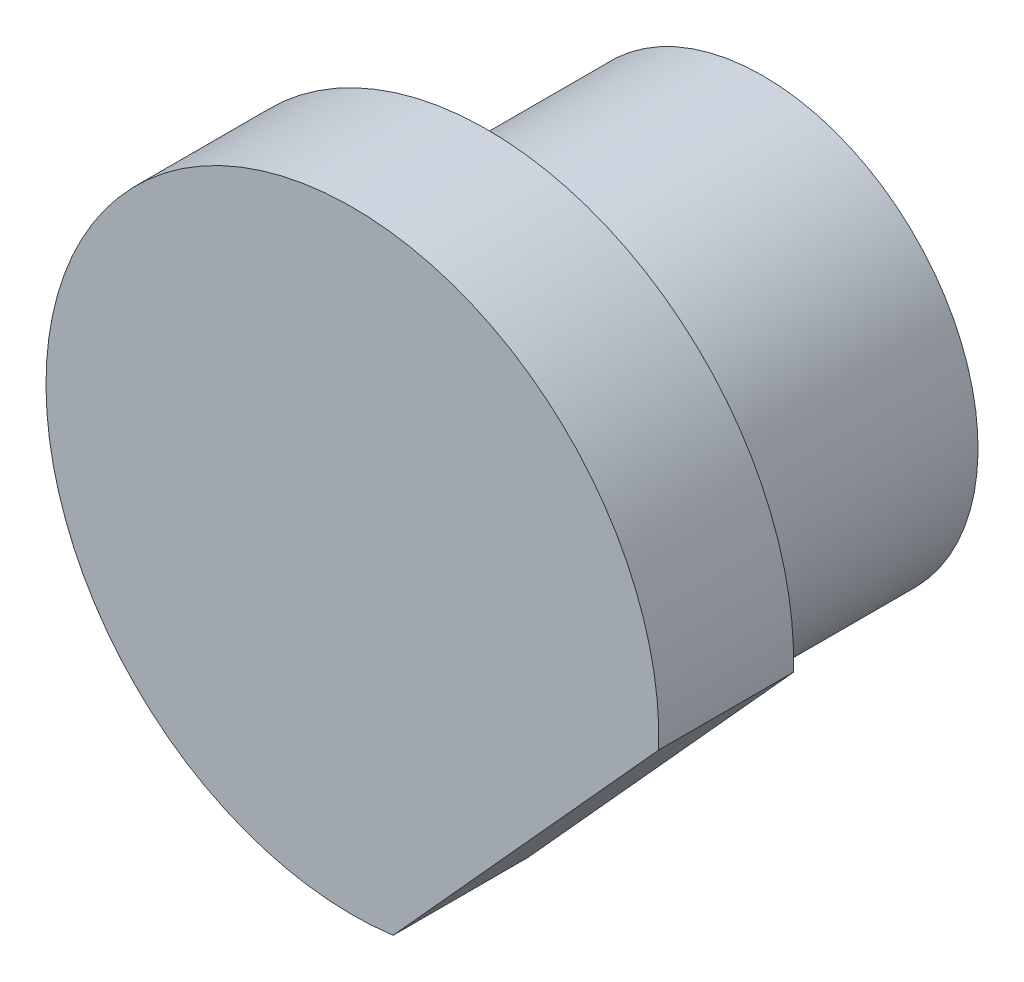
ISO-10303-21;
HEADER;
FILE_DESCRIPTION(('STEP AP214'),'2;1');
FILE_NAME('part.step','',(''),(''),'','','');
FILE_SCHEMA(('AUTOMOTIVE_DESIGN { 1 0 10303 214 1 1 1 1 }'));
ENDSEC;
DATA;
#1=APPLICATION_CONTEXT('core data for automotive mechanical design processes');
#2=APPLICATION_PROTOCOL_DEFINITION('international standard','automotive_design',2000,#1);
#3=PRODUCT_CONTEXT('',#1,'mechanical');
#4=PRODUCT('Part','Part','',(#3));
#5=PRODUCT_RELATED_PRODUCT_CATEGORY('part','',(#4));
#6=PRODUCT_DEFINITION_FORMATION('','',#4);
#7=PRODUCT_DEFINITION_CONTEXT('part definition',#1,'design');
#8=PRODUCT_DEFINITION('design','',#6,#7);
#9=PRODUCT_DEFINITION_SHAPE('','',#8);
#10=(LENGTH_UNIT() NAMED_UNIT(*) SI_UNIT(.MILLI.,.METRE.));
#11=(NAMED_UNIT(*) PLANE_ANGLE_UNIT() SI_UNIT($,.RADIAN.));
#12=(NAMED_UNIT(*) SI_UNIT($,.STERADIAN.) SOLID_ANGLE_UNIT());
#13=UNCERTAINTY_MEASURE_WITH_UNIT(LENGTH_MEASURE(1.E-05),#10,'distance_accuracy_value','');
#14=(GEOMETRIC_REPRESENTATION_CONTEXT(3) GLOBAL_UNCERTAINTY_ASSIGNED_CONTEXT((#13)) GLOBAL_UNIT_ASSIGNED_CONTEXT((#10,
#11,#12)) REPRESENTATION_CONTEXT('',''));
#15=CARTESIAN_POINT('',(0.,0.,0.));
#16=DIRECTION('',(0.,0.,1.));
#17=DIRECTION('',(1.,0.,0.));
#18=AXIS2_PLACEMENT_3D('',#15,#16,#17);
#19=CARTESIAN_POINT('',(0.,1.14926821060375,-6.68262260455928));
#20=DIRECTION('',(0.,0.,1.));
#21=DIRECTION('',(0.,-1.,0.));
#22=AXIS2_PLACEMENT_3D('',#19,#20,#21);
#23=CYLINDRICAL_SURFACE('',#22,3.50132981535273);
#24=CARTESIAN_POINT('',(0.,1.14926821060375,-6.68262260455928));
#25=DIRECTION('',(0.,0.,-1.));
#26=DIRECTION('',(0.,1.,0.));
#27=AXIS2_PLACEMENT_3D('',#24,#25,#26);
#28=CIRCLE('',#27,3.50132981535273);
#29=CARTESIAN_POINT('',(0.,4.65059802595648,-6.68262260455929));
#30=VERTEX_POINT('',#29);
#31=EDGE_CURVE('E11',#30,#30,#28,.T.);
#32=ORIENTED_EDGE('',*,*,#31,.F.);
#33=EDGE_LOOP('',(#32));
#34=FACE_BOUND('',#33,.T.);
#35=CARTESIAN_POINT('',(0.,1.14926821060376,-2.19073178939624));
#36=DIRECTION('',(0.,0.,-1.));
#37=DIRECTION('',(0.,1.,0.));
#38=AXIS2_PLACEMENT_3D('',#35,#36,#37);
#39=CIRCLE('',#38,3.50132981535273);
#40=CARTESIAN_POINT('',(0.,4.6505980259565,-2.19073178939625));
#41=VERTEX_POINT('',#40);
#42=EDGE_CURVE('E41',#41,#41,#39,.T.);
#43=ORIENTED_EDGE('',*,*,#42,.T.);
#44=EDGE_LOOP('',(#43));
#45=FACE_BOUND('',#44,.T.);
#46=ADVANCED_FACE('F38',(#34,#45),#23,.T.);
#47=CARTESIAN_POINT('',(0.,1.14926821060375,-6.68262260455928));
#48=DIRECTION('',(0.,0.,-1.));
#49=DIRECTION('',(0.,1.,0.));
#50=AXIS2_PLACEMENT_3D('',#47,#48,#49);
#51=PLANE('',#50);
#52=ORIENTED_EDGE('',*,*,#31,.T.);
#53=EDGE_LOOP('',(#52));
#54=FACE_BOUND('',#53,.T.);
#55=ADVANCED_FACE('F101',(#54),#51,.T.);
#56=CARTESIAN_POINT('',(0.,1.14926821060377,0.00262260455928011));
#57=DIRECTION('',(0.,0.,-1.));
#58=DIRECTION('',(0.,1.,0.));
#59=AXIS2_PLACEMENT_3D('',#56,#57,#58);
#60=CYLINDRICAL_SURFACE('',#59,4.98983893950316);
#61=CARTESIAN_POINT('',(0.,1.14926821060376,-2.19073178939624));
#62=DIRECTION('',(0.,0.,1.));
#63=DIRECTION('',(0.,-1.,0.));
#64=AXIS2_PLACEMENT_3D('',#61,#62,#63);
#65=CIRCLE('',#64,4.98983893950316);
#66=CARTESIAN_POINT('',(4.98691902887766,0.97858944332463,-2.19073178939624));
#67=VERTEX_POINT('',#66);
#68=CARTESIAN_POINT('',(0.662486278937899,-3.79639701991893,-2.19073178939622));
#69=VERTEX_POINT('',#68);
#70=EDGE_CURVE('E74',#67,#69,#65,.T.);
#71=ORIENTED_EDGE('',*,*,#70,.T.);
#72=DIRECTION('',(0.,0.,-1.));
#73=VECTOR('',#72,1.);
#74=CARTESIAN_POINT('',(0.662486278937899,-3.79639701991892,0.00262260455929746));
#75=LINE('',#74,#73);
#76=CARTESIAN_POINT('',(0.662486278937899,-3.79639701991892,0.00262260455929746));
#77=VERTEX_POINT('',#76);
#78=EDGE_CURVE('E70',#77,#69,#75,.T.);
#79=ORIENTED_EDGE('',*,*,#78,.F.);
#80=CARTESIAN_POINT('',(0.,1.14926821060377,0.00262260455928011));
#81=DIRECTION('',(0.,0.,1.));
#82=DIRECTION('',(0.,-1.,0.));
#83=AXIS2_PLACEMENT_3D('',#80,#81,#82);
#84=CIRCLE('',#83,4.98983893950316);
#85=CARTESIAN_POINT('',(4.98691902887766,0.978589443324638,0.00262260455928011));
#86=VERTEX_POINT('',#85);
#87=EDGE_CURVE('E73',#86,#77,#84,.T.);
#88=ORIENTED_EDGE('',*,*,#87,.F.);
#89=DIRECTION('',(0.,0.,-1.));
#90=VECTOR('',#89,1.);
#91=CARTESIAN_POINT('',(4.98691902887766,0.978589443324638,0.00262260455928011));
#92=LINE('',#91,#90);
#93=EDGE_CURVE('E67',#86,#67,#92,.T.);
#94=ORIENTED_EDGE('',*,*,#93,.T.);
#95=EDGE_LOOP('',(#71,#79,#88,#94));
#96=FACE_BOUND('',#95,.T.);
#97=ADVANCED_FACE('F77',(#96),#60,.T.);
#98=CARTESIAN_POINT('',(0.662486278937899,-3.79639701991892,0.00262260455929746));
#99=DIRECTION('',(-0.741210806519446,0.671272329460102,0.));
#100=DIRECTION('',(0.671272329460102,0.741210806519446,0.));
#101=AXIS2_PLACEMENT_3D('',#98,#99,#100);
#102=PLANE('',#101);
#103=DIRECTION('',(0.671272329460102,0.741210806519446,0.));
#104=VECTOR('',#103,1.);
#105=CARTESIAN_POINT('',(0.662486278937899,-3.79639701991893,-2.19073178939622));
#106=LINE('',#105,#104);
#107=EDGE_CURVE('E62',#69,#67,#106,.T.);
#108=ORIENTED_EDGE('',*,*,#107,.T.);
#109=ORIENTED_EDGE('',*,*,#93,.F.);
#110=DIRECTION('',(0.671272329460102,0.741210806519446,0.));
#111=VECTOR('',#110,1.);
#112=CARTESIAN_POINT('',(0.662486278937899,-3.79639701991892,0.00262260455929746));
#113=LINE('',#112,#111);
#114=EDGE_CURVE('E54',#77,#86,#113,.T.);
#115=ORIENTED_EDGE('',*,*,#114,.F.);
#116=ORIENTED_EDGE('',*,*,#78,.T.);
#117=EDGE_LOOP('',(#108,#109,#115,#116));
#118=FACE_BOUND('',#117,.T.);
#119=ADVANCED_FACE('F66',(#118),#102,.F.);
#120=CARTESIAN_POINT('',(0.,1.14926821060377,0.00262260455928011));
#121=DIRECTION('',(0.,0.,1.));
#122=DIRECTION('',(0.,-1.,0.));
#123=AXIS2_PLACEMENT_3D('',#120,#121,#122);
#124=PLANE('',#123);
#125=ORIENTED_EDGE('',*,*,#87,.T.);
#126=ORIENTED_EDGE('',*,*,#114,.T.);
#127=EDGE_LOOP('',(#125,#126));
#128=FACE_BOUND('',#127,.T.);
#129=ADVANCED_FACE('F93',(#128),#124,.T.);
#130=CARTESIAN_POINT('',(0.,1.14926821060376,-2.19073178939624));
#131=DIRECTION('',(0.,0.,1.));
#132=DIRECTION('',(0.,-1.,0.));
#133=AXIS2_PLACEMENT_3D('',#130,#131,#132);
#134=PLANE('',#133);
#135=ORIENTED_EDGE('',*,*,#42,.F.);
#136=EDGE_LOOP('',(#135));
#137=FACE_BOUND('',#136,.T.);
#138=ORIENTED_EDGE('',*,*,#70,.F.);
#139=ORIENTED_EDGE('',*,*,#107,.F.);
#140=EDGE_LOOP('',(#138,#139));
#141=FACE_BOUND('',#140,.T.);
#142=ADVANCED_FACE('F80',(#137,#141),#134,.F.);
#143=CLOSED_SHELL('',(#46,#55,#97,#119,#129,#142));
#144=MANIFOLD_SOLID_BREP('B2',#143);
#145=ADVANCED_BREP_SHAPE_REPRESENTATION('',(#18,#144),#14);
#146=SHAPE_DEFINITION_REPRESENTATION(#9,#145);
ENDSEC;
END-ISO-10303-21;
